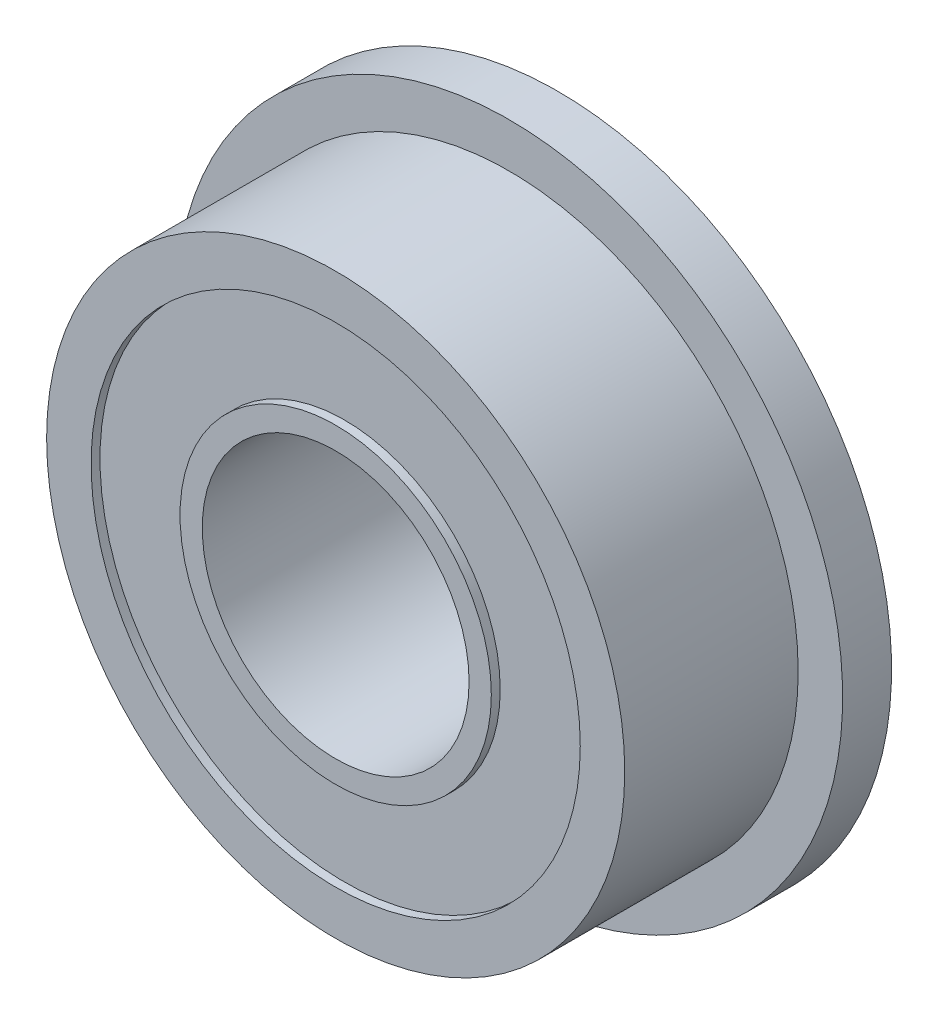
ISO-10303-21;
HEADER;
FILE_DESCRIPTION(('STEP AP214'),'2;1');
FILE_NAME('part.step','',(''),(''),'','','');
FILE_SCHEMA(('AUTOMOTIVE_DESIGN { 1 0 10303 214 1 1 1 1 }'));
ENDSEC;
DATA;
#1=APPLICATION_CONTEXT('core data for automotive mechanical design processes');
#2=APPLICATION_PROTOCOL_DEFINITION('international standard','automotive_design',2000,#1);
#3=PRODUCT_CONTEXT('',#1,'mechanical');
#4=PRODUCT('Part','Part','',(#3));
#5=PRODUCT_RELATED_PRODUCT_CATEGORY('part','',(#4));
#6=PRODUCT_DEFINITION_FORMATION('','',#4);
#7=PRODUCT_DEFINITION_CONTEXT('part definition',#1,'design');
#8=PRODUCT_DEFINITION('design','',#6,#7);
#9=PRODUCT_DEFINITION_SHAPE('','',#8);
#10=(LENGTH_UNIT() NAMED_UNIT(*) SI_UNIT(.MILLI.,.METRE.));
#11=(NAMED_UNIT(*) PLANE_ANGLE_UNIT() SI_UNIT($,.RADIAN.));
#12=(NAMED_UNIT(*) SI_UNIT($,.STERADIAN.) SOLID_ANGLE_UNIT());
#13=UNCERTAINTY_MEASURE_WITH_UNIT(LENGTH_MEASURE(1.E-05),#10,'distance_accuracy_value','');
#14=(GEOMETRIC_REPRESENTATION_CONTEXT(3) GLOBAL_UNCERTAINTY_ASSIGNED_CONTEXT((#13)) GLOBAL_UNIT_ASSIGNED_CONTEXT((#10,
#11,#12)) REPRESENTATION_CONTEXT('',''));
#15=CARTESIAN_POINT('',(0.,0.,0.));
#16=DIRECTION('',(0.,0.,1.));
#17=DIRECTION('',(1.,0.,0.));
#18=AXIS2_PLACEMENT_3D('',#15,#16,#17);
#19=CARTESIAN_POINT('',(0.,0.,-2.5));
#20=DIRECTION('',(0.,0.,1.));
#21=DIRECTION('',(1.,0.,0.));
#22=AXIS2_PLACEMENT_3D('',#19,#20,#21);
#23=PLANE('',#22);
#24=CARTESIAN_POINT('',(0.,0.,-2.5));
#25=DIRECTION('',(0.,0.,1.));
#26=DIRECTION('',(1.,0.,0.));
#27=AXIS2_PLACEMENT_3D('',#24,#25,#26);
#28=CIRCLE('',#27,3.);
#29=CARTESIAN_POINT('',(3.,0.,-2.5));
#30=VERTEX_POINT('',#29);
#31=EDGE_CURVE('E60',#30,#30,#28,.T.);
#32=ORIENTED_EDGE('',*,*,#31,.T.);
#33=EDGE_LOOP('',(#32));
#34=FACE_BOUND('',#33,.T.);
#35=CARTESIAN_POINT('',(0.,0.,-2.5));
#36=DIRECTION('',(0.,0.,1.));
#37=DIRECTION('',(1.,0.,0.));
#38=AXIS2_PLACEMENT_3D('',#35,#36,#37);
#39=CIRCLE('',#38,3.5);
#40=CARTESIAN_POINT('',(3.5,0.,-2.5));
#41=VERTEX_POINT('',#40);
#42=EDGE_CURVE('E94',#41,#41,#39,.T.);
#43=ORIENTED_EDGE('',*,*,#42,.F.);
#44=EDGE_LOOP('',(#43));
#45=FACE_BOUND('',#44,.T.);
#46=ADVANCED_FACE('F37',(#34,#45),#23,.F.);
#47=CARTESIAN_POINT('',(0.,0.,2.5));
#48=DIRECTION('',(0.,0.,1.));
#49=DIRECTION('',(1.,0.,0.));
#50=AXIS2_PLACEMENT_3D('',#47,#48,#49);
#51=PLANE('',#50);
#52=CARTESIAN_POINT('',(0.,0.,2.5));
#53=DIRECTION('',(0.,0.,1.));
#54=DIRECTION('',(1.,0.,0.));
#55=AXIS2_PLACEMENT_3D('',#52,#53,#54);
#56=CIRCLE('',#55,3.);
#57=CARTESIAN_POINT('',(3.,0.,2.5));
#58=VERTEX_POINT('',#57);
#59=EDGE_CURVE('E62',#58,#58,#56,.T.);
#60=ORIENTED_EDGE('',*,*,#59,.F.);
#61=EDGE_LOOP('',(#60));
#62=FACE_BOUND('',#61,.T.);
#63=CARTESIAN_POINT('',(0.,0.,2.5));
#64=DIRECTION('',(0.,0.,1.));
#65=DIRECTION('',(1.,0.,0.));
#66=AXIS2_PLACEMENT_3D('',#63,#64,#65);
#67=CIRCLE('',#66,3.5);
#68=CARTESIAN_POINT('',(3.5,0.,2.5));
#69=VERTEX_POINT('',#68);
#70=EDGE_CURVE('E78',#69,#69,#67,.T.);
#71=ORIENTED_EDGE('',*,*,#70,.T.);
#72=EDGE_LOOP('',(#71));
#73=FACE_BOUND('',#72,.T.);
#74=ADVANCED_FACE('F112',(#62,#73),#51,.T.);
#75=CARTESIAN_POINT('',(0.,0.,2.5));
#76=DIRECTION('',(0.,0.,-1.));
#77=DIRECTION('',(-1.,0.,0.));
#78=AXIS2_PLACEMENT_3D('',#75,#76,#77);
#79=CYLINDRICAL_SURFACE('',#78,6.5);
#80=CARTESIAN_POINT('',(0.,0.,2.5));
#81=DIRECTION('',(0.,0.,1.));
#82=DIRECTION('',(1.,0.,0.));
#83=AXIS2_PLACEMENT_3D('',#80,#81,#82);
#84=CIRCLE('',#83,6.5);
#85=CARTESIAN_POINT('',(6.5,0.,2.5));
#86=VERTEX_POINT('',#85);
#87=EDGE_CURVE('E45',#86,#86,#84,.T.);
#88=ORIENTED_EDGE('',*,*,#87,.F.);
#89=EDGE_LOOP('',(#88));
#90=FACE_BOUND('',#89,.T.);
#91=CARTESIAN_POINT('',(0.,0.,-1.4));
#92=DIRECTION('',(0.,0.,-1.));
#93=DIRECTION('',(-1.,0.,0.));
#94=AXIS2_PLACEMENT_3D('',#91,#92,#93);
#95=CIRCLE('',#94,6.5);
#96=CARTESIAN_POINT('',(-6.5,0.,-1.4));
#97=VERTEX_POINT('',#96);
#98=EDGE_CURVE('E10',#97,#97,#95,.T.);
#99=ORIENTED_EDGE('',*,*,#98,.F.);
#100=EDGE_LOOP('',(#99));
#101=FACE_BOUND('',#100,.T.);
#102=ADVANCED_FACE('F39',(#90,#101),#79,.T.);
#103=CARTESIAN_POINT('',(0.,0.,2.5));
#104=DIRECTION('',(0.,0.,1.));
#105=DIRECTION('',(1.,0.,0.));
#106=AXIS2_PLACEMENT_3D('',#103,#104,#105);
#107=CIRCLE('',#106,5.5);
#108=CARTESIAN_POINT('',(5.5,0.,2.5));
#109=VERTEX_POINT('',#108);
#110=EDGE_CURVE('E70',#109,#109,#107,.T.);
#111=ORIENTED_EDGE('',*,*,#110,.F.);
#112=EDGE_LOOP('',(#111));
#113=FACE_BOUND('',#112,.T.);
#114=ORIENTED_EDGE('',*,*,#87,.T.);
#115=EDGE_LOOP('',(#114));
#116=FACE_BOUND('',#115,.T.);
#117=ADVANCED_FACE('F120',(#113,#116),#51,.T.);
#118=CARTESIAN_POINT('',(0.,0.,-1.4));
#119=DIRECTION('',(0.,0.,-1.));
#120=DIRECTION('',(-1.,0.,0.));
#121=AXIS2_PLACEMENT_3D('',#118,#119,#120);
#122=CYLINDRICAL_SURFACE('',#121,7.5);
#123=CARTESIAN_POINT('',(0.,0.,-1.4));
#124=DIRECTION('',(0.,0.,-1.));
#125=DIRECTION('',(-1.,0.,0.));
#126=AXIS2_PLACEMENT_3D('',#123,#124,#125);
#127=CIRCLE('',#126,7.5);
#128=CARTESIAN_POINT('',(-7.5,0.,-1.4));
#129=VERTEX_POINT('',#128);
#130=EDGE_CURVE('E50',#129,#129,#127,.T.);
#131=ORIENTED_EDGE('',*,*,#130,.T.);
#132=EDGE_LOOP('',(#131));
#133=FACE_BOUND('',#132,.T.);
#134=CARTESIAN_POINT('',(0.,0.,-2.5));
#135=DIRECTION('',(0.,0.,-1.));
#136=DIRECTION('',(-1.,0.,0.));
#137=AXIS2_PLACEMENT_3D('',#134,#135,#136);
#138=CIRCLE('',#137,7.5);
#139=CARTESIAN_POINT('',(-7.5,0.,-2.5));
#140=VERTEX_POINT('',#139);
#141=EDGE_CURVE('E55',#140,#140,#138,.T.);
#142=ORIENTED_EDGE('',*,*,#141,.F.);
#143=EDGE_LOOP('',(#142));
#144=FACE_BOUND('',#143,.T.);
#145=ADVANCED_FACE('F132',(#133,#144),#122,.T.);
#146=CARTESIAN_POINT('',(0.,0.,-1.4));
#147=DIRECTION('',(0.,0.,-1.));
#148=DIRECTION('',(-1.,0.,0.));
#149=AXIS2_PLACEMENT_3D('',#146,#147,#148);
#150=PLANE('',#149);
#151=ORIENTED_EDGE('',*,*,#98,.T.);
#152=EDGE_LOOP('',(#151));
#153=FACE_BOUND('',#152,.T.);
#154=ORIENTED_EDGE('',*,*,#130,.F.);
#155=EDGE_LOOP('',(#154));
#156=FACE_BOUND('',#155,.T.);
#157=ADVANCED_FACE('F123',(#153,#156),#150,.F.);
#158=CARTESIAN_POINT('',(0.,0.,-2.5));
#159=DIRECTION('',(0.,0.,1.));
#160=DIRECTION('',(1.,0.,0.));
#161=AXIS2_PLACEMENT_3D('',#158,#159,#160);
#162=CIRCLE('',#161,5.5);
#163=CARTESIAN_POINT('',(5.5,0.,-2.5));
#164=VERTEX_POINT('',#163);
#165=EDGE_CURVE('E86',#164,#164,#162,.T.);
#166=ORIENTED_EDGE('',*,*,#165,.T.);
#167=EDGE_LOOP('',(#166));
#168=FACE_BOUND('',#167,.T.);
#169=ORIENTED_EDGE('',*,*,#141,.T.);
#170=EDGE_LOOP('',(#169));
#171=FACE_BOUND('',#170,.T.);
#172=ADVANCED_FACE('F114',(#168,#171),#23,.F.);
#173=CARTESIAN_POINT('',(0.,0.,-2.5));
#174=DIRECTION('',(0.,0.,1.));
#175=DIRECTION('',(1.,0.,0.));
#176=AXIS2_PLACEMENT_3D('',#173,#174,#175);
#177=CYLINDRICAL_SURFACE('',#176,3.);
#178=ORIENTED_EDGE('',*,*,#31,.F.);
#179=EDGE_LOOP('',(#178));
#180=FACE_BOUND('',#179,.T.);
#181=ORIENTED_EDGE('',*,*,#59,.T.);
#182=EDGE_LOOP('',(#181));
#183=FACE_BOUND('',#182,.T.);
#184=ADVANCED_FACE('F122',(#180,#183),#177,.F.);
#185=CARTESIAN_POINT('',(0.,0.,2.3));
#186=DIRECTION('',(0.,0.,1.));
#187=DIRECTION('',(1.,0.,0.));
#188=AXIS2_PLACEMENT_3D('',#185,#186,#187);
#189=CYLINDRICAL_SURFACE('',#188,5.5);
#190=CARTESIAN_POINT('',(0.,0.,2.3));
#191=DIRECTION('',(0.,0.,1.));
#192=DIRECTION('',(1.,0.,0.));
#193=AXIS2_PLACEMENT_3D('',#190,#191,#192);
#194=CIRCLE('',#193,5.5);
#195=CARTESIAN_POINT('',(5.5,0.,2.3));
#196=VERTEX_POINT('',#195);
#197=EDGE_CURVE('E66',#196,#196,#194,.T.);
#198=ORIENTED_EDGE('',*,*,#197,.F.);
#199=EDGE_LOOP('',(#198));
#200=FACE_BOUND('',#199,.T.);
#201=ORIENTED_EDGE('',*,*,#110,.T.);
#202=EDGE_LOOP('',(#201));
#203=FACE_BOUND('',#202,.T.);
#204=ADVANCED_FACE('F129',(#200,#203),#189,.F.);
#205=CARTESIAN_POINT('',(0.,0.,2.3));
#206=DIRECTION('',(0.,0.,1.));
#207=DIRECTION('',(1.,0.,0.));
#208=AXIS2_PLACEMENT_3D('',#205,#206,#207);
#209=PLANE('',#208);
#210=CARTESIAN_POINT('',(0.,0.,2.3));
#211=DIRECTION('',(0.,0.,1.));
#212=DIRECTION('',(1.,0.,0.));
#213=AXIS2_PLACEMENT_3D('',#210,#211,#212);
#214=CIRCLE('',#213,3.5);
#215=CARTESIAN_POINT('',(3.5,0.,2.3));
#216=VERTEX_POINT('',#215);
#217=EDGE_CURVE('E74',#216,#216,#214,.T.);
#218=ORIENTED_EDGE('',*,*,#217,.F.);
#219=EDGE_LOOP('',(#218));
#220=FACE_BOUND('',#219,.T.);
#221=ORIENTED_EDGE('',*,*,#197,.T.);
#222=EDGE_LOOP('',(#221));
#223=FACE_BOUND('',#222,.T.);
#224=ADVANCED_FACE('F148',(#220,#223),#209,.T.);
#225=CARTESIAN_POINT('',(0.,0.,2.3));
#226=DIRECTION('',(0.,0.,1.));
#227=DIRECTION('',(1.,0.,0.));
#228=AXIS2_PLACEMENT_3D('',#225,#226,#227);
#229=CYLINDRICAL_SURFACE('',#228,3.5);
#230=ORIENTED_EDGE('',*,*,#217,.T.);
#231=EDGE_LOOP('',(#230));
#232=FACE_BOUND('',#231,.T.);
#233=ORIENTED_EDGE('',*,*,#70,.F.);
#234=EDGE_LOOP('',(#233));
#235=FACE_BOUND('',#234,.T.);
#236=ADVANCED_FACE('F152',(#232,#235),#229,.T.);
#237=CARTESIAN_POINT('',(0.,0.,-2.3));
#238=DIRECTION('',(0.,0.,-1.));
#239=DIRECTION('',(1.,0.,0.));
#240=AXIS2_PLACEMENT_3D('',#237,#238,#239);
#241=PLANE('',#240);
#242=CARTESIAN_POINT('',(0.,0.,-2.3));
#243=DIRECTION('',(0.,0.,1.));
#244=DIRECTION('',(1.,0.,0.));
#245=AXIS2_PLACEMENT_3D('',#242,#243,#244);
#246=CIRCLE('',#245,5.5);
#247=CARTESIAN_POINT('',(5.5,0.,-2.3));
#248=VERTEX_POINT('',#247);
#249=EDGE_CURVE('E82',#248,#248,#246,.T.);
#250=ORIENTED_EDGE('',*,*,#249,.F.);
#251=EDGE_LOOP('',(#250));
#252=FACE_BOUND('',#251,.T.);
#253=CARTESIAN_POINT('',(0.,0.,-2.3));
#254=DIRECTION('',(0.,0.,1.));
#255=DIRECTION('',(1.,0.,0.));
#256=AXIS2_PLACEMENT_3D('',#253,#254,#255);
#257=CIRCLE('',#256,3.5);
#258=CARTESIAN_POINT('',(3.5,0.,-2.3));
#259=VERTEX_POINT('',#258);
#260=EDGE_CURVE('E90',#259,#259,#257,.T.);
#261=ORIENTED_EDGE('',*,*,#260,.T.);
#262=EDGE_LOOP('',(#261));
#263=FACE_BOUND('',#262,.T.);
#264=ADVANCED_FACE('F102',(#252,#263),#241,.T.);
#265=CARTESIAN_POINT('',(0.,0.,-2.3));
#266=DIRECTION('',(0.,0.,-1.));
#267=DIRECTION('',(-1.,0.,0.));
#268=AXIS2_PLACEMENT_3D('',#265,#266,#267);
#269=CYLINDRICAL_SURFACE('',#268,5.5);
#270=ORIENTED_EDGE('',*,*,#249,.T.);
#271=EDGE_LOOP('',(#270));
#272=FACE_BOUND('',#271,.T.);
#273=ORIENTED_EDGE('',*,*,#165,.F.);
#274=EDGE_LOOP('',(#273));
#275=FACE_BOUND('',#274,.T.);
#276=ADVANCED_FACE('F107',(#272,#275),#269,.F.);
#277=CARTESIAN_POINT('',(0.,0.,-2.3));
#278=DIRECTION('',(0.,0.,-1.));
#279=DIRECTION('',(-1.,0.,0.));
#280=AXIS2_PLACEMENT_3D('',#277,#278,#279);
#281=CYLINDRICAL_SURFACE('',#280,3.5);
#282=ORIENTED_EDGE('',*,*,#260,.F.);
#283=EDGE_LOOP('',(#282));
#284=FACE_BOUND('',#283,.T.);
#285=ORIENTED_EDGE('',*,*,#42,.T.);
#286=EDGE_LOOP('',(#285));
#287=FACE_BOUND('',#286,.T.);
#288=ADVANCED_FACE('F104',(#284,#287),#281,.T.);
#289=CLOSED_SHELL('',(#46,#74,#102,#117,#145,#157,#172,#184,#204,#224,#236,#264,#276,#288));
#290=MANIFOLD_SOLID_BREP('B2',#289);
#291=ADVANCED_BREP_SHAPE_REPRESENTATION('',(#18,#290),#14);
#292=SHAPE_DEFINITION_REPRESENTATION(#9,#291);
ENDSEC;
END-ISO-10303-21;
